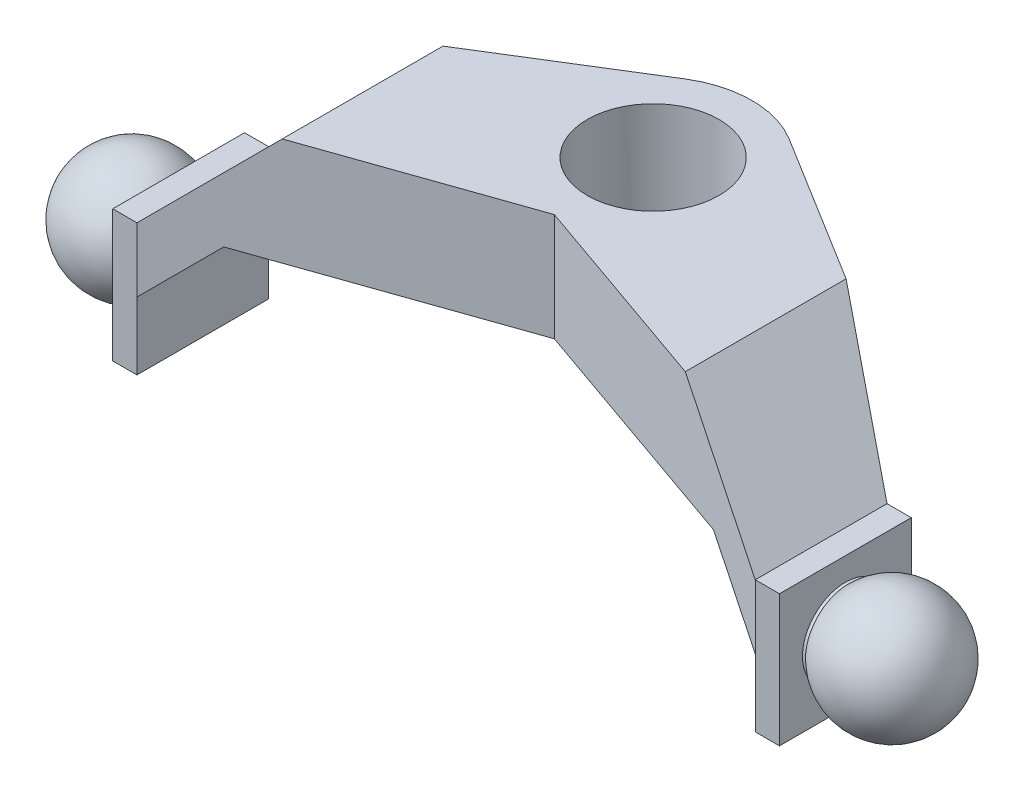
ISO-10303-21;
HEADER;
FILE_DESCRIPTION(('STEP AP214'),'2;1');
FILE_NAME('part.step','',(''),(''),'','','');
FILE_SCHEMA(('AUTOMOTIVE_DESIGN { 1 0 10303 214 1 1 1 1 }'));
ENDSEC;
DATA;
#1=APPLICATION_CONTEXT('core data for automotive mechanical design processes');
#2=APPLICATION_PROTOCOL_DEFINITION('international standard','automotive_design',2000,#1);
#3=PRODUCT_CONTEXT('',#1,'mechanical');
#4=PRODUCT('Part','Part','',(#3));
#5=PRODUCT_RELATED_PRODUCT_CATEGORY('part','',(#4));
#6=PRODUCT_DEFINITION_FORMATION('','',#4);
#7=PRODUCT_DEFINITION_CONTEXT('part definition',#1,'design');
#8=PRODUCT_DEFINITION('design','',#6,#7);
#9=PRODUCT_DEFINITION_SHAPE('','',#8);
#10=(LENGTH_UNIT() NAMED_UNIT(*) SI_UNIT(.MILLI.,.METRE.));
#11=(NAMED_UNIT(*) PLANE_ANGLE_UNIT() SI_UNIT($,.RADIAN.));
#12=(NAMED_UNIT(*) SI_UNIT($,.STERADIAN.) SOLID_ANGLE_UNIT());
#13=UNCERTAINTY_MEASURE_WITH_UNIT(LENGTH_MEASURE(1.E-05),#10,'distance_accuracy_value','');
#14=(GEOMETRIC_REPRESENTATION_CONTEXT(3) GLOBAL_UNCERTAINTY_ASSIGNED_CONTEXT((#13)) GLOBAL_UNIT_ASSIGNED_CONTEXT((#10,
#11,#12)) REPRESENTATION_CONTEXT('',''));
#15=CARTESIAN_POINT('',(0.,0.,0.));
#16=DIRECTION('',(0.,0.,1.));
#17=DIRECTION('',(1.,0.,0.));
#18=AXIS2_PLACEMENT_3D('',#15,#16,#17);
#19=CARTESIAN_POINT('',(16.9973884374056,-5.08,2.90109799845974));
#20=DIRECTION('',(0.,0.,-1.));
#21=DIRECTION('',(-1.,0.,0.));
#22=AXIS2_PLACEMENT_3D('',#19,#20,#21);
#23=PLANE('',#22);
#24=DIRECTION('',(-1.,0.,0.));
#25=VECTOR('',#24,1.);
#26=CARTESIAN_POINT('',(16.9973884374056,0.,2.90109799845974));
#27=LINE('',#26,#25);
#28=CARTESIAN_POINT('',(12.8511978976028,0.,2.90109799845974));
#29=VERTEX_POINT('',#28);
#30=CARTESIAN_POINT('',(11.9173884374056,0.,2.90109799845974));
#31=VERTEX_POINT('',#30);
#32=EDGE_CURVE('E206',#29,#31,#27,.T.);
#33=ORIENTED_EDGE('',*,*,#32,.F.);
#34=DIRECTION('',(0.,-1.,0.));
#35=VECTOR('',#34,1.);
#36=CARTESIAN_POINT('',(12.8511978976028,-5.08,2.90109799845974));
#37=LINE('',#36,#35);
#38=CARTESIAN_POINT('',(12.8511978976028,-5.08,2.90109799845974));
#39=VERTEX_POINT('',#38);
#40=EDGE_CURVE('E47',#29,#39,#37,.T.);
#41=ORIENTED_EDGE('',*,*,#40,.T.);
#42=DIRECTION('',(-1.,0.,0.));
#43=VECTOR('',#42,1.);
#44=CARTESIAN_POINT('',(16.9973884374056,-5.08,2.90109799845974));
#45=LINE('',#44,#43);
#46=CARTESIAN_POINT('',(11.9173884374056,-5.08,2.90109799845974));
#47=VERTEX_POINT('',#46);
#48=EDGE_CURVE('E239',#39,#47,#45,.T.);
#49=ORIENTED_EDGE('',*,*,#48,.T.);
#50=DIRECTION('',(0.,1.,0.));
#51=VECTOR('',#50,1.);
#52=CARTESIAN_POINT('',(11.9173884374056,-5.08,2.90109799845974));
#53=LINE('',#52,#51);
#54=CARTESIAN_POINT('',(11.9173884374056,-2.47833074218577,2.90109799845974));
#55=VERTEX_POINT('',#54);
#56=EDGE_CURVE('E264',#47,#55,#53,.T.);
#57=ORIENTED_EDGE('',*,*,#56,.T.);
#58=EDGE_CURVE('E267',#55,#31,#53,.T.);
#59=ORIENTED_EDGE('',*,*,#58,.T.);
#60=EDGE_LOOP('',(#33,#41,#49,#57,#59));
#61=FACE_BOUND('',#60,.T.);
#62=ADVANCED_FACE('F33',(#61),#23,.T.);
#63=CARTESIAN_POINT('',(11.9173884374056,-5.08,7.98109799845975));
#64=DIRECTION('',(0.,0.,1.));
#65=DIRECTION('',(1.,0.,0.));
#66=AXIS2_PLACEMENT_3D('',#63,#64,#65);
#67=PLANE('',#66);
#68=DIRECTION('',(1.,0.,0.));
#69=VECTOR('',#68,1.);
#70=CARTESIAN_POINT('',(11.9173884374056,-5.08,7.98109799845975));
#71=LINE('',#70,#69);
#72=CARTESIAN_POINT('',(11.9173884374056,-5.08,7.98109799845975));
#73=VERTEX_POINT('',#72);
#74=CARTESIAN_POINT('',(12.8511978976028,-5.08,7.98109799845975));
#75=VERTEX_POINT('',#74);
#76=EDGE_CURVE('E171',#73,#75,#71,.T.);
#77=ORIENTED_EDGE('',*,*,#76,.T.);
#78=DIRECTION('',(0.,1.,0.));
#79=VECTOR('',#78,1.);
#80=CARTESIAN_POINT('',(12.8511978976028,-5.08,7.98109799845975));
#81=LINE('',#80,#79);
#82=CARTESIAN_POINT('',(12.8511978976028,0.,7.98109799845975));
#83=VERTEX_POINT('',#82);
#84=EDGE_CURVE('E157',#75,#83,#81,.T.);
#85=ORIENTED_EDGE('',*,*,#84,.T.);
#86=DIRECTION('',(1.,0.,0.));
#87=VECTOR('',#86,1.);
#88=CARTESIAN_POINT('',(11.9173884374056,0.,7.98109799845975));
#89=LINE('',#88,#87);
#90=CARTESIAN_POINT('',(11.9173884374056,0.,7.98109799845975));
#91=VERTEX_POINT('',#90);
#92=EDGE_CURVE('E167',#91,#83,#89,.T.);
#93=ORIENTED_EDGE('',*,*,#92,.F.);
#94=DIRECTION('',(0.,1.,0.));
#95=VECTOR('',#94,1.);
#96=CARTESIAN_POINT('',(11.9173884374056,-5.08,7.98109799845975));
#97=LINE('',#96,#95);
#98=CARTESIAN_POINT('',(11.9173884374056,-2.47833074218577,7.98109799845975));
#99=VERTEX_POINT('',#98);
#100=EDGE_CURVE('E246',#99,#91,#97,.T.);
#101=ORIENTED_EDGE('',*,*,#100,.F.);
#102=EDGE_CURVE('E268',#73,#99,#97,.T.);
#103=ORIENTED_EDGE('',*,*,#102,.F.);
#104=EDGE_LOOP('',(#77,#85,#93,#101,#103));
#105=FACE_BOUND('',#104,.T.);
#106=ADVANCED_FACE('F165',(#105),#67,.T.);
#107=CARTESIAN_POINT('',(0.,-5.08,0.));
#108=DIRECTION('',(0.,-1.,0.));
#109=DIRECTION('',(0.,0.,-1.));
#110=AXIS2_PLACEMENT_3D('',#107,#108,#109);
#111=PLANE('',#110);
#112=ORIENTED_EDGE('',*,*,#48,.F.);
#113=DIRECTION('',(0.,0.,1.));
#114=VECTOR('',#113,1.);
#115=CARTESIAN_POINT('',(12.8511978976028,-5.08,0.));
#116=LINE('',#115,#114);
#117=EDGE_CURVE('E334',#39,#75,#116,.T.);
#118=ORIENTED_EDGE('',*,*,#117,.T.);
#119=ORIENTED_EDGE('',*,*,#76,.F.);
#120=DIRECTION('',(0.,0.,1.));
#121=VECTOR('',#120,1.);
#122=CARTESIAN_POINT('',(11.9173884374056,-5.08,0.));
#123=LINE('',#122,#121);
#124=EDGE_CURVE('E250',#47,#73,#123,.T.);
#125=ORIENTED_EDGE('',*,*,#124,.F.);
#126=EDGE_LOOP('',(#112,#118,#119,#125));
#127=FACE_BOUND('',#126,.T.);
#128=ADVANCED_FACE('F361',(#127),#111,.T.);
#129=CARTESIAN_POINT('',(11.9173884374056,0.,-3.81));
#130=DIRECTION('',(0.,-1.,0.));
#131=DIRECTION('',(0.,0.,-1.));
#132=AXIS2_PLACEMENT_3D('',#129,#130,#131);
#133=PLANE('',#132);
#134=DIRECTION('',(0.,0.,1.));
#135=VECTOR('',#134,1.);
#136=CARTESIAN_POINT('',(12.8511978976028,0.,-3.81));
#137=LINE('',#136,#135);
#138=EDGE_CURVE('E11',#29,#83,#137,.T.);
#139=ORIENTED_EDGE('',*,*,#138,.F.);
#140=ORIENTED_EDGE('',*,*,#32,.T.);
#141=DIRECTION('',(0.,0.,1.));
#142=VECTOR('',#141,1.);
#143=CARTESIAN_POINT('',(11.9173884374056,0.,-3.81));
#144=LINE('',#143,#142);
#145=EDGE_CURVE('E176',#31,#91,#144,.T.);
#146=ORIENTED_EDGE('',*,*,#145,.T.);
#147=ORIENTED_EDGE('',*,*,#92,.T.);
#148=EDGE_LOOP('',(#139,#140,#146,#147));
#149=FACE_BOUND('',#148,.T.);
#150=ADVANCED_FACE('F174',(#149),#133,.F.);
#151=DIRECTION('',(1.,0.,0.));
#152=VECTOR('',#151,1.);
#153=CARTESIAN_POINT('',(-16.9973884374056,-5.08,7.98109799845975));
#154=LINE('',#153,#152);
#155=CARTESIAN_POINT('',(-12.8511978976028,-5.08,7.98109799845975));
#156=VERTEX_POINT('',#155);
#157=CARTESIAN_POINT('',(-11.9173884374056,-5.08,7.98109799845975));
#158=VERTEX_POINT('',#157);
#159=EDGE_CURVE('E244',#156,#158,#154,.T.);
#160=ORIENTED_EDGE('',*,*,#159,.F.);
#161=DIRECTION('',(0.,0.,-1.));
#162=VECTOR('',#161,1.);
#163=CARTESIAN_POINT('',(-12.8511978976028,-5.08,0.));
#164=LINE('',#163,#162);
#165=CARTESIAN_POINT('',(-12.8511978976028,-5.08,2.90109799845974));
#166=VERTEX_POINT('',#165);
#167=EDGE_CURVE('E184',#156,#166,#164,.T.);
#168=ORIENTED_EDGE('',*,*,#167,.T.);
#169=DIRECTION('',(-1.,0.,0.));
#170=VECTOR('',#169,1.);
#171=CARTESIAN_POINT('',(-11.9173884374056,-5.08,2.90109799845974));
#172=LINE('',#171,#170);
#173=CARTESIAN_POINT('',(-11.9173884374056,-5.08,2.90109799845975));
#174=VERTEX_POINT('',#173);
#175=EDGE_CURVE('E241',#174,#166,#172,.T.);
#176=ORIENTED_EDGE('',*,*,#175,.F.);
#177=DIRECTION('',(0.,0.,-1.));
#178=VECTOR('',#177,1.);
#179=CARTESIAN_POINT('',(-11.9173884374056,-5.08,0.));
#180=LINE('',#179,#178);
#181=EDGE_CURVE('E274',#158,#174,#180,.T.);
#182=ORIENTED_EDGE('',*,*,#181,.F.);
#183=EDGE_LOOP('',(#160,#168,#176,#182));
#184=FACE_BOUND('',#183,.T.);
#185=ADVANCED_FACE('F326',(#184),#111,.T.);
#186=CARTESIAN_POINT('',(-16.9973884374056,-5.08,7.98109799845975));
#187=DIRECTION('',(0.,0.,1.));
#188=DIRECTION('',(1.,0.,0.));
#189=AXIS2_PLACEMENT_3D('',#186,#187,#188);
#190=PLANE('',#189);
#191=DIRECTION('',(1.,0.,0.));
#192=VECTOR('',#191,1.);
#193=CARTESIAN_POINT('',(-18.0934878348703,0.,7.98109799845975));
#194=LINE('',#193,#192);
#195=CARTESIAN_POINT('',(-12.8511978976028,0.,7.98109799845975));
#196=VERTEX_POINT('',#195);
#197=CARTESIAN_POINT('',(-11.9173884374056,0.,7.98109799845975));
#198=VERTEX_POINT('',#197);
#199=EDGE_CURVE('E179',#196,#198,#194,.T.);
#200=ORIENTED_EDGE('',*,*,#199,.F.);
#201=DIRECTION('',(0.,-1.,0.));
#202=VECTOR('',#201,1.);
#203=CARTESIAN_POINT('',(-12.8511978976028,-5.08,7.98109799845975));
#204=LINE('',#203,#202);
#205=EDGE_CURVE('E55',#196,#156,#204,.T.);
#206=ORIENTED_EDGE('',*,*,#205,.T.);
#207=ORIENTED_EDGE('',*,*,#159,.T.);
#208=DIRECTION('',(0.,1.,0.));
#209=VECTOR('',#208,1.);
#210=CARTESIAN_POINT('',(-11.9173884374056,-5.08,7.98109799845975));
#211=LINE('',#210,#209);
#212=CARTESIAN_POINT('',(-11.9173884374056,-2.47833074218578,7.98109799845975));
#213=VERTEX_POINT('',#212);
#214=EDGE_CURVE('E251',#158,#213,#211,.T.);
#215=ORIENTED_EDGE('',*,*,#214,.T.);
#216=EDGE_CURVE('E254',#213,#198,#211,.T.);
#217=ORIENTED_EDGE('',*,*,#216,.T.);
#218=EDGE_LOOP('',(#200,#206,#207,#215,#217));
#219=FACE_BOUND('',#218,.T.);
#220=ADVANCED_FACE('F318',(#219),#190,.T.);
#221=CARTESIAN_POINT('',(-11.9173884374056,-5.08,2.90109799845974));
#222=DIRECTION('',(0.,0.,-1.));
#223=DIRECTION('',(-1.,0.,0.));
#224=AXIS2_PLACEMENT_3D('',#221,#222,#223);
#225=PLANE('',#224);
#226=ORIENTED_EDGE('',*,*,#175,.T.);
#227=DIRECTION('',(0.,1.,0.));
#228=VECTOR('',#227,1.);
#229=CARTESIAN_POINT('',(-12.8511978976028,-5.08,2.90109799845974));
#230=LINE('',#229,#228);
#231=CARTESIAN_POINT('',(-12.8511978976028,0.,2.90109799845974));
#232=VERTEX_POINT('',#231);
#233=EDGE_CURVE('E291',#166,#232,#230,.T.);
#234=ORIENTED_EDGE('',*,*,#233,.T.);
#235=DIRECTION('',(-1.,0.,0.));
#236=VECTOR('',#235,1.);
#237=CARTESIAN_POINT('',(-11.9173884374056,0.,2.90109799845974));
#238=LINE('',#237,#236);
#239=CARTESIAN_POINT('',(-11.9173884374056,0.,2.90109799845975));
#240=VERTEX_POINT('',#239);
#241=EDGE_CURVE('E286',#240,#232,#238,.T.);
#242=ORIENTED_EDGE('',*,*,#241,.F.);
#243=DIRECTION('',(0.,1.,0.));
#244=VECTOR('',#243,1.);
#245=CARTESIAN_POINT('',(-11.9173884374056,-5.08,2.90109799845974));
#246=LINE('',#245,#244);
#247=CARTESIAN_POINT('',(-11.9173884374056,-2.47833074218578,2.90109799845975));
#248=VERTEX_POINT('',#247);
#249=EDGE_CURVE('E257',#248,#240,#246,.T.);
#250=ORIENTED_EDGE('',*,*,#249,.F.);
#251=EDGE_CURVE('E255',#174,#248,#246,.T.);
#252=ORIENTED_EDGE('',*,*,#251,.F.);
#253=EDGE_LOOP('',(#226,#234,#242,#250,#252));
#254=FACE_BOUND('',#253,.T.);
#255=ADVANCED_FACE('F297',(#254),#225,.T.);
#256=CARTESIAN_POINT('',(-18.0934878348703,0.,-3.81));
#257=DIRECTION('',(0.,-1.,0.));
#258=DIRECTION('',(1.,0.,0.));
#259=AXIS2_PLACEMENT_3D('',#256,#257,#258);
#260=PLANE('',#259);
#261=DIRECTION('',(0.,0.,-1.));
#262=VECTOR('',#261,1.);
#263=CARTESIAN_POINT('',(-12.8511978976028,0.,-3.81));
#264=LINE('',#263,#262);
#265=EDGE_CURVE('E41',#196,#232,#264,.T.);
#266=ORIENTED_EDGE('',*,*,#265,.F.);
#267=ORIENTED_EDGE('',*,*,#199,.T.);
#268=DIRECTION('',(0.,0.,1.));
#269=VECTOR('',#268,1.);
#270=CARTESIAN_POINT('',(-11.9173884374056,0.,-3.81));
#271=LINE('',#270,#269);
#272=EDGE_CURVE('E178',#240,#198,#271,.T.);
#273=ORIENTED_EDGE('',*,*,#272,.F.);
#274=ORIENTED_EDGE('',*,*,#241,.T.);
#275=EDGE_LOOP('',(#266,#267,#273,#274));
#276=FACE_BOUND('',#275,.T.);
#277=ADVANCED_FACE('F305',(#276),#260,.F.);
#278=CARTESIAN_POINT('',(0.,-5.08,3.81));
#279=DIRECTION('',(-0.330351274611299,0.,0.94385805890647));
#280=DIRECTION('',(0.943858058906471,0.,0.330351274611299));
#281=AXIS2_PLACEMENT_3D('',#278,#279,#280);
#282=PLANE('',#281);
#283=DIRECTION('',(0.686398108651958,-0.686398108651954,0.240240031797438));
#284=VECTOR('',#283,1.);
#285=CARTESIAN_POINT('',(8.00818976276335,3.90919867464219,6.61287451115589));
#286=LINE('',#285,#284);
#287=CARTESIAN_POINT('',(7.76945426660322,4.14793417080232,6.5293168462006));
#288=VERTEX_POINT('',#287);
#289=EDGE_CURVE('E208',#288,#91,#286,.T.);
#290=ORIENTED_EDGE('',*,*,#289,.F.);
#291=DIRECTION('',(0.943858058906471,0.,0.330351274611299));
#292=VECTOR('',#291,1.);
#293=CARTESIAN_POINT('',(0.,4.14793417080232,3.81));
#294=LINE('',#293,#292);
#295=CARTESIAN_POINT('',(0.,4.14793417080232,3.81));
#296=VERTEX_POINT('',#295);
#297=EDGE_CURVE('E204',#296,#288,#294,.T.);
#298=ORIENTED_EDGE('',*,*,#297,.F.);
#299=DIRECTION('',(0.,1.,0.));
#300=VECTOR('',#299,1.);
#301=CARTESIAN_POINT('',(0.,-5.08,3.81));
#302=LINE('',#301,#300);
#303=CARTESIAN_POINT('',(0.,0.,3.81));
#304=VERTEX_POINT('',#303);
#305=EDGE_CURVE('E247',#304,#296,#302,.T.);
#306=ORIENTED_EDGE('',*,*,#305,.F.);
#307=DIRECTION('',(-0.943858058906471,0.,-0.330351274611299));
#308=VECTOR('',#307,1.);
#309=CARTESIAN_POINT('',(0.,0.,3.81));
#310=LINE('',#309,#308);
#311=CARTESIAN_POINT('',(9.43905769521978,0.,7.11367973374949));
#312=VERTEX_POINT('',#311);
#313=EDGE_CURVE('E232',#312,#304,#310,.T.);
#314=ORIENTED_EDGE('',*,*,#313,.F.);
#315=DIRECTION('',(-0.686398108651958,0.686398108651955,-0.240240031797438));
#316=VECTOR('',#315,1.);
#317=CARTESIAN_POINT('',(6.84054315920411,2.59851453601566,6.20419701972434));
#318=LINE('',#317,#316);
#319=EDGE_CURVE('E234',#99,#312,#318,.T.);
#320=ORIENTED_EDGE('',*,*,#319,.F.);
#321=ORIENTED_EDGE('',*,*,#100,.T.);
#322=EDGE_LOOP('',(#290,#298,#306,#314,#320,#321));
#323=FACE_BOUND('',#322,.T.);
#324=ADVANCED_FACE('F35',(#323),#282,.T.);
#325=CARTESIAN_POINT('',(-11.9173884374056,-5.08,7.98109799845975));
#326=DIRECTION('',(0.330351274611299,0.,0.94385805890647));
#327=DIRECTION('',(0.943858058906471,0.,-0.330351274611299));
#328=AXIS2_PLACEMENT_3D('',#325,#326,#327);
#329=PLANE('',#328);
#330=DIRECTION('',(0.943858058906471,0.,-0.330351274611299));
#331=VECTOR('',#330,1.);
#332=CARTESIAN_POINT('',(-11.9173884374056,4.14793417080232,7.98109799845975));
#333=LINE('',#332,#331);
#334=CARTESIAN_POINT('',(-7.76945426660324,4.14793417080232,6.52931684620061));
#335=VERTEX_POINT('',#334);
#336=EDGE_CURVE('E202',#335,#296,#333,.T.);
#337=ORIENTED_EDGE('',*,*,#336,.F.);
#338=DIRECTION('',(0.686398108651956,0.686398108651956,-0.240240031797438));
#339=VECTOR('',#338,1.);
#340=CARTESIAN_POINT('',(-14.3107916442954,-2.39340320688979,8.81879153997684));
#341=LINE('',#340,#339);
#342=EDGE_CURVE('E210',#198,#335,#341,.T.);
#343=ORIENTED_EDGE('',*,*,#342,.F.);
#344=ORIENTED_EDGE('',*,*,#216,.F.);
#345=DIRECTION('',(-0.686398108651955,-0.686398108651958,0.240240031797437));
#346=VECTOR('',#345,1.);
#347=CARTESIAN_POINT('',(-13.1431450407361,-3.70408734551633,8.41011404854529));
#348=LINE('',#347,#346);
#349=CARTESIAN_POINT('',(-9.43905769521979,0.,7.11367973374949));
#350=VERTEX_POINT('',#349);
#351=EDGE_CURVE('E236',#350,#213,#348,.T.);
#352=ORIENTED_EDGE('',*,*,#351,.F.);
#353=DIRECTION('',(-0.943858058906471,0.,0.330351274611299));
#354=VECTOR('',#353,1.);
#355=CARTESIAN_POINT('',(-11.9173884374056,0.,7.98109799845975));
#356=LINE('',#355,#354);
#357=EDGE_CURVE('E230',#304,#350,#356,.T.);
#358=ORIENTED_EDGE('',*,*,#357,.F.);
#359=ORIENTED_EDGE('',*,*,#305,.T.);
#360=EDGE_LOOP('',(#337,#343,#344,#352,#358,#359));
#361=FACE_BOUND('',#360,.T.);
#362=ADVANCED_FACE('F315',(#361),#329,.T.);
#363=CARTESIAN_POINT('',(-2.0065029414497,-5.08,-3.23883404112556));
#364=DIRECTION('',(-0.526641191981544,0.,-0.850087674836107));
#365=DIRECTION('',(-0.850087674836107,0.,0.526641191981544));
#366=AXIS2_PLACEMENT_3D('',#363,#364,#365);
#367=PLANE('',#366);
#368=DIRECTION('',(-0.850087674836107,0.,0.526641191981544));
#369=VECTOR('',#368,1.);
#370=CARTESIAN_POINT('',(-2.0065029414497,4.14793417080232,-3.23883404112556));
#371=LINE('',#370,#369);
#372=CARTESIAN_POINT('',(-2.0065029414497,4.14793417080232,-3.23883404112556));
#373=VERTEX_POINT('',#372);
#374=CARTESIAN_POINT('',(-7.76945426660325,4.14793417080232,0.331394824733029));
#375=VERTEX_POINT('',#374);
#376=EDGE_CURVE('E200',#373,#375,#371,.T.);
#377=ORIENTED_EDGE('',*,*,#376,.F.);
#378=DIRECTION('',(0.,1.,0.));
#379=VECTOR('',#378,1.);
#380=CARTESIAN_POINT('',(-2.0065029414497,-5.08,-3.23883404112556));
#381=LINE('',#380,#379);
#382=CARTESIAN_POINT('',(-2.0065029414497,0.,-3.23883404112556));
#383=VERTEX_POINT('',#382);
#384=EDGE_CURVE('E258',#383,#373,#381,.T.);
#385=ORIENTED_EDGE('',*,*,#384,.F.);
#386=DIRECTION('',(0.850087674836107,0.,-0.526641191981544));
#387=VECTOR('',#386,1.);
#388=CARTESIAN_POINT('',(-2.0065029414497,0.,-3.23883404112556));
#389=LINE('',#388,#387);
#390=CARTESIAN_POINT('',(-9.43905769521979,0.,1.36573747645141));
#391=VERTEX_POINT('',#390);
#392=EDGE_CURVE('E228',#391,#383,#389,.T.);
#393=ORIENTED_EDGE('',*,*,#392,.F.);
#394=DIRECTION('',(0.647687200106948,0.64768720010695,-0.401251269948448));
#395=VECTOR('',#394,1.);
#396=CARTESIAN_POINT('',(-7.2555035092301,2.1835541859897,0.0129951496230509));
#397=LINE('',#396,#395);
#398=EDGE_CURVE('E278',#248,#391,#397,.T.);
#399=ORIENTED_EDGE('',*,*,#398,.F.);
#400=ORIENTED_EDGE('',*,*,#249,.T.);
#401=DIRECTION('',(-0.647687200106949,-0.647687200106949,0.401251269948449));
#402=VECTOR('',#401,1.);
#403=CARTESIAN_POINT('',(-8.29516005650402,3.62222838090154,0.657076906735125));
#404=LINE('',#403,#402);
#405=EDGE_CURVE('E284',#375,#240,#404,.T.);
#406=ORIENTED_EDGE('',*,*,#405,.F.);
#407=EDGE_LOOP('',(#377,#385,#393,#399,#400,#406));
#408=FACE_BOUND('',#407,.T.);
#409=ADVANCED_FACE('F371',(#408),#367,.T.);
#410=CARTESIAN_POINT('',(0.,-5.08,0.));
#411=DIRECTION('',(0.,1.,0.));
#412=DIRECTION('',(0.,0.,1.));
#413=AXIS2_PLACEMENT_3D('',#410,#411,#412);
#414=CYLINDRICAL_SURFACE('',#413,3.81);
#415=CARTESIAN_POINT('',(0.,4.14793417080232,0.));
#416=DIRECTION('',(0.,-1.,0.));
#417=DIRECTION('',(0.,0.,-1.));
#418=AXIS2_PLACEMENT_3D('',#415,#416,#417);
#419=CIRCLE('',#418,3.81);
#420=CARTESIAN_POINT('',(2.0065029414497,4.14793417080232,-3.23883404112556));
#421=VERTEX_POINT('',#420);
#422=EDGE_CURVE('E198',#421,#373,#419,.F.);
#423=ORIENTED_EDGE('',*,*,#422,.F.);
#424=DIRECTION('',(0.,1.,0.));
#425=VECTOR('',#424,1.);
#426=CARTESIAN_POINT('',(2.0065029414497,-5.08,-3.23883404112556));
#427=LINE('',#426,#425);
#428=CARTESIAN_POINT('',(2.0065029414497,0.,-3.23883404112556));
#429=VERTEX_POINT('',#428);
#430=EDGE_CURVE('E261',#429,#421,#427,.T.);
#431=ORIENTED_EDGE('',*,*,#430,.F.);
#432=CARTESIAN_POINT('',(0.,0.,0.));
#433=DIRECTION('',(0.,1.,0.));
#434=DIRECTION('',(0.,0.,1.));
#435=AXIS2_PLACEMENT_3D('',#432,#433,#434);
#436=CIRCLE('',#435,3.81);
#437=EDGE_CURVE('E226',#383,#429,#436,.F.);
#438=ORIENTED_EDGE('',*,*,#437,.F.);
#439=ORIENTED_EDGE('',*,*,#384,.T.);
#440=EDGE_LOOP('',(#423,#431,#438,#439));
#441=FACE_BOUND('',#440,.T.);
#442=ADVANCED_FACE('F367',(#441),#414,.T.);
#443=CARTESIAN_POINT('',(2.0065029414497,-5.08,-3.23883404112556));
#444=DIRECTION('',(0.526641191981544,0.,-0.850087674836107));
#445=DIRECTION('',(-0.850087674836107,0.,-0.526641191981544));
#446=AXIS2_PLACEMENT_3D('',#443,#444,#445);
#447=PLANE('',#446);
#448=DIRECTION('',(-0.64768720010695,0.647687200106946,-0.40125126994845));
#449=VECTOR('',#448,1.);
#450=CARTESIAN_POINT('',(8.295160056504,3.62222838090155,0.657076906735108));
#451=LINE('',#450,#449);
#452=CARTESIAN_POINT('',(7.76945426660322,4.14793417080232,0.331394824733015));
#453=VERTEX_POINT('',#452);
#454=EDGE_CURVE('E280',#31,#453,#451,.T.);
#455=ORIENTED_EDGE('',*,*,#454,.F.);
#456=ORIENTED_EDGE('',*,*,#58,.F.);
#457=DIRECTION('',(0.64768720010695,-0.647687200106947,0.40125126994845));
#458=VECTOR('',#457,1.);
#459=CARTESIAN_POINT('',(7.25550350923006,2.18355418598971,0.012995149623031));
#460=LINE('',#459,#458);
#461=CARTESIAN_POINT('',(9.43905769521978,0.,1.3657374764514));
#462=VERTEX_POINT('',#461);
#463=EDGE_CURVE('E276',#462,#55,#460,.T.);
#464=ORIENTED_EDGE('',*,*,#463,.F.);
#465=DIRECTION('',(0.850087674836107,0.,0.526641191981544));
#466=VECTOR('',#465,1.);
#467=CARTESIAN_POINT('',(2.0065029414497,0.,-3.23883404112556));
#468=LINE('',#467,#466);
#469=EDGE_CURVE('E224',#429,#462,#468,.T.);
#470=ORIENTED_EDGE('',*,*,#469,.F.);
#471=ORIENTED_EDGE('',*,*,#430,.T.);
#472=DIRECTION('',(-0.850087674836107,0.,-0.526641191981544));
#473=VECTOR('',#472,1.);
#474=CARTESIAN_POINT('',(2.0065029414497,4.14793417080232,-3.23883404112556));
#475=LINE('',#474,#473);
#476=EDGE_CURVE('E195',#453,#421,#475,.T.);
#477=ORIENTED_EDGE('',*,*,#476,.F.);
#478=EDGE_LOOP('',(#455,#456,#464,#470,#471,#477));
#479=FACE_BOUND('',#478,.T.);
#480=ADVANCED_FACE('F363',(#479),#447,.T.);
#481=CARTESIAN_POINT('',(0.,-5.08,0.));
#482=DIRECTION('',(0.,1.,0.));
#483=DIRECTION('',(0.,0.,1.));
#484=AXIS2_PLACEMENT_3D('',#481,#482,#483);
#485=CYLINDRICAL_SURFACE('',#484,2.54);
#486=CARTESIAN_POINT('',(0.,4.14793417080232,0.));
#487=DIRECTION('',(0.,-1.,0.));
#488=DIRECTION('',(0.,0.,-1.));
#489=AXIS2_PLACEMENT_3D('',#486,#487,#488);
#490=CIRCLE('',#489,2.54);
#491=CARTESIAN_POINT('',(0.,4.14793417080232,-2.54));
#492=VERTEX_POINT('',#491);
#493=EDGE_CURVE('E189',#492,#492,#490,.F.);
#494=ORIENTED_EDGE('',*,*,#493,.T.);
#495=EDGE_LOOP('',(#494));
#496=FACE_BOUND('',#495,.T.);
#497=CARTESIAN_POINT('',(0.,0.,0.));
#498=DIRECTION('',(0.,1.,0.));
#499=DIRECTION('',(0.,0.,1.));
#500=AXIS2_PLACEMENT_3D('',#497,#498,#499);
#501=CIRCLE('',#500,2.54);
#502=CARTESIAN_POINT('',(0.,0.,2.54));
#503=VERTEX_POINT('',#502);
#504=EDGE_CURVE('E216',#503,#503,#501,.F.);
#505=ORIENTED_EDGE('',*,*,#504,.T.);
#506=EDGE_LOOP('',(#505));
#507=FACE_BOUND('',#506,.T.);
#508=ADVANCED_FACE('F366',(#496,#507),#485,.F.);
#509=CARTESIAN_POINT('',(-9.43905769521979,0.,-3.81));
#510=DIRECTION('',(0.,1.,0.));
#511=DIRECTION('',(0.,0.,1.));
#512=AXIS2_PLACEMENT_3D('',#509,#510,#511);
#513=PLANE('',#512);
#514=ORIENTED_EDGE('',*,*,#313,.T.);
#515=ORIENTED_EDGE('',*,*,#357,.T.);
#516=DIRECTION('',(0.,0.,1.));
#517=VECTOR('',#516,1.);
#518=CARTESIAN_POINT('',(-9.43905769521979,0.,-3.81));
#519=LINE('',#518,#517);
#520=EDGE_CURVE('E217',#391,#350,#519,.T.);
#521=ORIENTED_EDGE('',*,*,#520,.F.);
#522=ORIENTED_EDGE('',*,*,#392,.T.);
#523=ORIENTED_EDGE('',*,*,#437,.T.);
#524=ORIENTED_EDGE('',*,*,#469,.T.);
#525=DIRECTION('',(0.,0.,1.));
#526=VECTOR('',#525,1.);
#527=CARTESIAN_POINT('',(9.43905769521978,0.,-3.81));
#528=LINE('',#527,#526);
#529=EDGE_CURVE('E220',#462,#312,#528,.T.);
#530=ORIENTED_EDGE('',*,*,#529,.T.);
#531=EDGE_LOOP('',(#514,#515,#521,#522,#523,#524,#530));
#532=FACE_BOUND('',#531,.T.);
#533=ORIENTED_EDGE('',*,*,#504,.F.);
#534=EDGE_LOOP('',(#533));
#535=FACE_BOUND('',#534,.T.);
#536=ADVANCED_FACE('F387',(#532,#535),#513,.F.);
#537=CARTESIAN_POINT('',(-11.9173884374056,-6.52525590909284,-3.81));
#538=DIRECTION('',(-1.,0.,0.));
#539=DIRECTION('',(0.,-1.,0.));
#540=AXIS2_PLACEMENT_3D('',#537,#538,#539);
#541=PLANE('',#540);
#542=ORIENTED_EDGE('',*,*,#251,.T.);
#543=DIRECTION('',(0.,0.,1.));
#544=VECTOR('',#543,1.);
#545=CARTESIAN_POINT('',(-11.9173884374056,-2.47833074218578,-3.81));
#546=LINE('',#545,#544);
#547=EDGE_CURVE('E213',#248,#213,#546,.T.);
#548=ORIENTED_EDGE('',*,*,#547,.T.);
#549=ORIENTED_EDGE('',*,*,#214,.F.);
#550=ORIENTED_EDGE('',*,*,#181,.T.);
#551=EDGE_LOOP('',(#542,#548,#549,#550));
#552=FACE_BOUND('',#551,.T.);
#553=ADVANCED_FACE('F323',(#552),#541,.F.);
#554=CARTESIAN_POINT('',(-11.9173884374056,-2.47833074218578,-3.81));
#555=DIRECTION('',(-0.707106781186549,0.707106781186546,0.));
#556=DIRECTION('',(-0.707106781186546,-0.707106781186549,0.));
#557=AXIS2_PLACEMENT_3D('',#554,#555,#556);
#558=PLANE('',#557);
#559=ORIENTED_EDGE('',*,*,#351,.T.);
#560=ORIENTED_EDGE('',*,*,#547,.F.);
#561=ORIENTED_EDGE('',*,*,#398,.T.);
#562=ORIENTED_EDGE('',*,*,#520,.T.);
#563=EDGE_LOOP('',(#559,#560,#561,#562));
#564=FACE_BOUND('',#563,.T.);
#565=ADVANCED_FACE('F397',(#564),#558,.F.);
#566=CARTESIAN_POINT('',(9.43905769521978,0.,-3.81));
#567=DIRECTION('',(0.707106781186546,0.707106781186549,0.));
#568=DIRECTION('',(-0.707106781186549,0.707106781186546,0.));
#569=AXIS2_PLACEMENT_3D('',#566,#567,#568);
#570=PLANE('',#569);
#571=ORIENTED_EDGE('',*,*,#319,.T.);
#572=ORIENTED_EDGE('',*,*,#529,.F.);
#573=ORIENTED_EDGE('',*,*,#463,.T.);
#574=DIRECTION('',(0.,0.,1.));
#575=VECTOR('',#574,1.);
#576=CARTESIAN_POINT('',(11.9173884374056,-2.47833074218577,-3.81));
#577=LINE('',#576,#575);
#578=EDGE_CURVE('E212',#55,#99,#577,.T.);
#579=ORIENTED_EDGE('',*,*,#578,.T.);
#580=EDGE_LOOP('',(#571,#572,#573,#579));
#581=FACE_BOUND('',#580,.T.);
#582=ADVANCED_FACE('F393',(#581),#570,.F.);
#583=CARTESIAN_POINT('',(11.9173884374056,-2.47833074218577,-3.81));
#584=DIRECTION('',(1.,0.,0.));
#585=DIRECTION('',(0.,1.,0.));
#586=AXIS2_PLACEMENT_3D('',#583,#584,#585);
#587=PLANE('',#586);
#588=ORIENTED_EDGE('',*,*,#56,.F.);
#589=ORIENTED_EDGE('',*,*,#124,.T.);
#590=ORIENTED_EDGE('',*,*,#102,.T.);
#591=ORIENTED_EDGE('',*,*,#578,.F.);
#592=EDGE_LOOP('',(#588,#589,#590,#591));
#593=FACE_BOUND('',#592,.T.);
#594=ADVANCED_FACE('F389',(#593),#587,.F.);
#595=CARTESIAN_POINT('',(-7.76945426660325,4.14793417080232,-3.81));
#596=DIRECTION('',(0.,-1.,0.));
#597=DIRECTION('',(0.,0.,-1.));
#598=AXIS2_PLACEMENT_3D('',#595,#596,#597);
#599=PLANE('',#598);
#600=ORIENTED_EDGE('',*,*,#297,.T.);
#601=DIRECTION('',(0.,0.,1.));
#602=VECTOR('',#601,1.);
#603=CARTESIAN_POINT('',(7.76945426660322,4.14793417080232,-3.81));
#604=LINE('',#603,#602);
#605=EDGE_CURVE('E190',#453,#288,#604,.T.);
#606=ORIENTED_EDGE('',*,*,#605,.F.);
#607=ORIENTED_EDGE('',*,*,#476,.T.);
#608=ORIENTED_EDGE('',*,*,#422,.T.);
#609=ORIENTED_EDGE('',*,*,#376,.T.);
#610=DIRECTION('',(0.,0.,1.));
#611=VECTOR('',#610,1.);
#612=CARTESIAN_POINT('',(-7.76945426660325,4.14793417080232,-3.81));
#613=LINE('',#612,#611);
#614=EDGE_CURVE('E182',#375,#335,#613,.T.);
#615=ORIENTED_EDGE('',*,*,#614,.T.);
#616=ORIENTED_EDGE('',*,*,#336,.T.);
#617=EDGE_LOOP('',(#600,#606,#607,#608,#609,#615,#616));
#618=FACE_BOUND('',#617,.T.);
#619=ORIENTED_EDGE('',*,*,#493,.F.);
#620=EDGE_LOOP('',(#619));
#621=FACE_BOUND('',#620,.T.);
#622=ADVANCED_FACE('F392',(#618,#621),#599,.F.);
#623=CARTESIAN_POINT('',(7.76945426660322,4.14793417080232,-3.81));
#624=DIRECTION('',(-0.707106781186546,-0.70710678118655,0.));
#625=DIRECTION('',(0.70710678118655,-0.707106781186546,0.));
#626=AXIS2_PLACEMENT_3D('',#623,#624,#625);
#627=PLANE('',#626);
#628=ORIENTED_EDGE('',*,*,#289,.T.);
#629=ORIENTED_EDGE('',*,*,#145,.F.);
#630=ORIENTED_EDGE('',*,*,#454,.T.);
#631=ORIENTED_EDGE('',*,*,#605,.T.);
#632=EDGE_LOOP('',(#628,#629,#630,#631));
#633=FACE_BOUND('',#632,.T.);
#634=ADVANCED_FACE('F412',(#633),#627,.F.);
#635=CARTESIAN_POINT('',(-11.9173884374056,0.,-3.81));
#636=DIRECTION('',(0.707106781186547,-0.707106781186547,0.));
#637=DIRECTION('',(0.707106781186548,0.707106781186548,0.));
#638=AXIS2_PLACEMENT_3D('',#635,#636,#637);
#639=PLANE('',#638);
#640=ORIENTED_EDGE('',*,*,#342,.T.);
#641=ORIENTED_EDGE('',*,*,#614,.F.);
#642=ORIENTED_EDGE('',*,*,#405,.T.);
#643=ORIENTED_EDGE('',*,*,#272,.T.);
#644=EDGE_LOOP('',(#640,#641,#642,#643));
#645=FACE_BOUND('',#644,.T.);
#646=ADVANCED_FACE('F308',(#645),#639,.F.);
#647=CARTESIAN_POINT('',(-14.6429824153206,-2.54,5.44109799845974));
#648=DIRECTION('',(-1.,0.,0.));
#649=DIRECTION('',(0.,-1.,0.));
#650=AXIS2_PLACEMENT_3D('',#647,#648,#649);
#651=SPHERICAL_SURFACE('',#650,2.354406022085);
#652=CARTESIAN_POINT('',(-16.9973884374056,-2.54,5.44109799845974));
#653=VERTEX_POINT('',#652);
#654=VERTEX_LOOP('',#653);
#655=FACE_BOUND('',#654,.T.);
#656=CARTESIAN_POINT('',(-12.9676339787159,-2.54,5.44109799845974));
#657=DIRECTION('',(-1.,0.,0.));
#658=DIRECTION('',(0.,0.,1.));
#659=AXIS2_PLACEMENT_3D('',#656,#657,#658);
#660=CIRCLE('',#659,1.65421743818533);
#661=CARTESIAN_POINT('',(-12.9676339787159,-2.54,7.09531543664507));
#662=VERTEX_POINT('',#661);
#663=EDGE_CURVE('E302',#662,#662,#660,.T.);
#664=ORIENTED_EDGE('',*,*,#663,.T.);
#665=EDGE_LOOP('',(#664));
#666=FACE_BOUND('',#665,.T.);
#667=ADVANCED_FACE('F411',(#655,#666),#651,.T.);
#668=CARTESIAN_POINT('',(-16.9973884374056,-2.54,5.44109799845974));
#669=DIRECTION('',(-1.,0.,0.));
#670=DIRECTION('',(0.,0.,1.));
#671=AXIS2_PLACEMENT_3D('',#668,#669,#670);
#672=CYLINDRICAL_SURFACE('',#671,1.65421743818533);
#673=CARTESIAN_POINT('',(-12.8511978976028,-2.54,5.44109799845974));
#674=DIRECTION('',(-1.,0.,0.));
#675=DIRECTION('',(0.,0.,1.));
#676=AXIS2_PLACEMENT_3D('',#673,#674,#675);
#677=CIRCLE('',#676,1.65421743818533);
#678=CARTESIAN_POINT('',(-12.8511978976028,-2.54,7.09531543664507));
#679=VERTEX_POINT('',#678);
#680=EDGE_CURVE('E331',#679,#679,#677,.T.);
#681=ORIENTED_EDGE('',*,*,#680,.T.);
#682=EDGE_LOOP('',(#681));
#683=FACE_BOUND('',#682,.T.);
#684=ORIENTED_EDGE('',*,*,#663,.F.);
#685=EDGE_LOOP('',(#684));
#686=FACE_BOUND('',#685,.T.);
#687=ADVANCED_FACE('F423',(#683,#686),#672,.T.);
#688=CARTESIAN_POINT('',(-12.8511978976028,-0.885782561814672,5.44109799845974));
#689=DIRECTION('',(-1.,0.,0.));
#690=DIRECTION('',(0.,0.,1.));
#691=AXIS2_PLACEMENT_3D('',#688,#689,#690);
#692=PLANE('',#691);
#693=ORIENTED_EDGE('',*,*,#205,.F.);
#694=ORIENTED_EDGE('',*,*,#265,.T.);
#695=ORIENTED_EDGE('',*,*,#233,.F.);
#696=ORIENTED_EDGE('',*,*,#167,.F.);
#697=EDGE_LOOP('',(#693,#694,#695,#696));
#698=FACE_BOUND('',#697,.T.);
#699=ORIENTED_EDGE('',*,*,#680,.F.);
#700=EDGE_LOOP('',(#699));
#701=FACE_BOUND('',#700,.T.);
#702=ADVANCED_FACE('F289',(#698,#701),#692,.T.);
#703=CARTESIAN_POINT('',(14.6429824153206,-2.53999999999999,5.44109799845974));
#704=DIRECTION('',(-1.,0.,0.));
#705=DIRECTION('',(0.,1.,0.));
#706=AXIS2_PLACEMENT_3D('',#703,#704,#705);
#707=SPHERICAL_SURFACE('',#706,2.354406022085);
#708=CARTESIAN_POINT('',(16.9973884374056,-2.53999999999999,5.44109799845974));
#709=VERTEX_POINT('',#708);
#710=VERTEX_LOOP('',#709);
#711=FACE_BOUND('',#710,.T.);
#712=CARTESIAN_POINT('',(12.9676339787159,-2.54,5.44109799845974));
#713=DIRECTION('',(-1.,0.,0.));
#714=DIRECTION('',(0.,0.,1.));
#715=AXIS2_PLACEMENT_3D('',#712,#713,#714);
#716=CIRCLE('',#715,1.65421743818533);
#717=CARTESIAN_POINT('',(12.9676339787159,-2.54,7.09531543664508));
#718=VERTEX_POINT('',#717);
#719=EDGE_CURVE('E172',#718,#718,#716,.T.);
#720=ORIENTED_EDGE('',*,*,#719,.F.);
#721=EDGE_LOOP('',(#720));
#722=FACE_BOUND('',#721,.T.);
#723=ADVANCED_FACE('F345',(#711,#722),#707,.T.);
#724=CARTESIAN_POINT('',(-16.9973884374056,-2.54,5.44109799845974));
#725=DIRECTION('',(-1.,0.,0.));
#726=DIRECTION('',(0.,0.,1.));
#727=AXIS2_PLACEMENT_3D('',#724,#725,#726);
#728=CYLINDRICAL_SURFACE('',#727,1.65421743818533);
#729=ORIENTED_EDGE('',*,*,#719,.T.);
#730=EDGE_LOOP('',(#729));
#731=FACE_BOUND('',#730,.T.);
#732=CARTESIAN_POINT('',(12.8511978976028,-2.54,5.44109799845974));
#733=DIRECTION('',(-1.,0.,0.));
#734=DIRECTION('',(0.,0.,1.));
#735=AXIS2_PLACEMENT_3D('',#732,#733,#734);
#736=CIRCLE('',#735,1.65421743818533);
#737=CARTESIAN_POINT('',(12.8511978976028,-2.54,7.09531543664508));
#738=VERTEX_POINT('',#737);
#739=EDGE_CURVE('E339',#738,#738,#736,.T.);
#740=ORIENTED_EDGE('',*,*,#739,.F.);
#741=EDGE_LOOP('',(#740));
#742=FACE_BOUND('',#741,.T.);
#743=ADVANCED_FACE('F343',(#731,#742),#728,.T.);
#744=CARTESIAN_POINT('',(12.8511978976028,-0.885782561814665,5.44109799845974));
#745=DIRECTION('',(1.,0.,0.));
#746=DIRECTION('',(0.,0.,-1.));
#747=AXIS2_PLACEMENT_3D('',#744,#745,#746);
#748=PLANE('',#747);
#749=ORIENTED_EDGE('',*,*,#40,.F.);
#750=ORIENTED_EDGE('',*,*,#138,.T.);
#751=ORIENTED_EDGE('',*,*,#84,.F.);
#752=ORIENTED_EDGE('',*,*,#117,.F.);
#753=EDGE_LOOP('',(#749,#750,#751,#752));
#754=FACE_BOUND('',#753,.T.);
#755=ORIENTED_EDGE('',*,*,#739,.T.);
#756=EDGE_LOOP('',(#755));
#757=FACE_BOUND('',#756,.T.);
#758=ADVANCED_FACE('F155',(#754,#757),#748,.T.);
#759=CLOSED_SHELL('',(#62,#106,#128,#150,#185,#220,#255,#277,#324,#362,#409,#442,#480,#508,#536,
#553,#565,#582,#594,#622,#634,#646,#667,#687,#702,#723,#743,#758));
#760=MANIFOLD_SOLID_BREP('B2',#759);
#761=ADVANCED_BREP_SHAPE_REPRESENTATION('',(#18,#760),#14);
#762=SHAPE_DEFINITION_REPRESENTATION(#9,#761);
ENDSEC;
END-ISO-10303-21;
